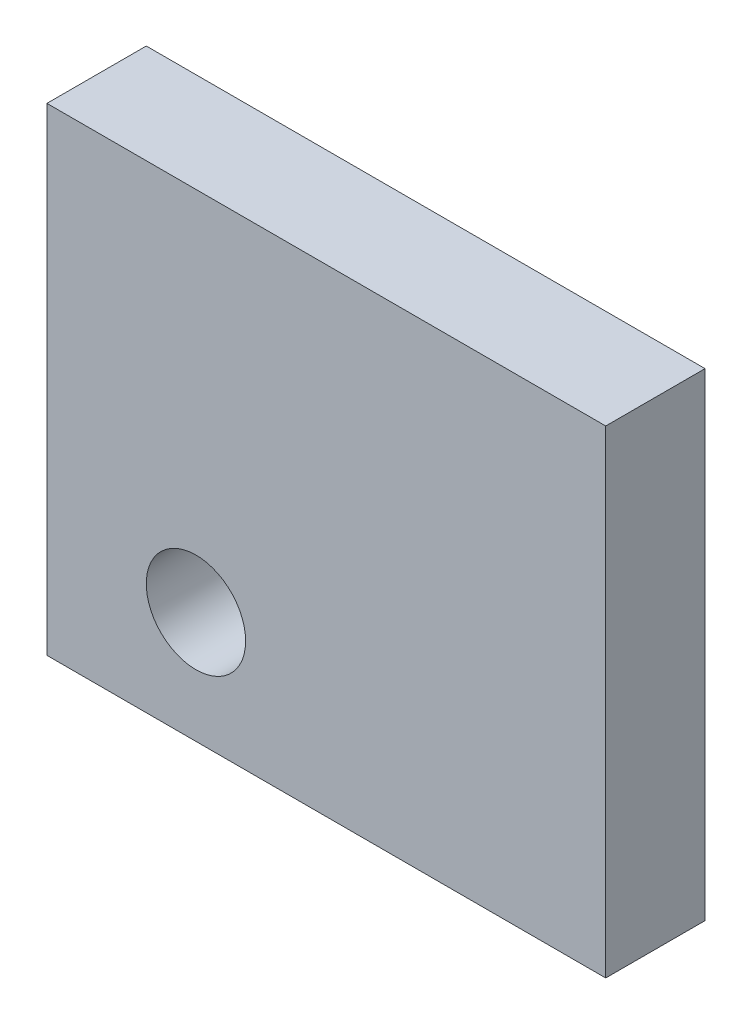
ISO-10303-21;
HEADER;
FILE_DESCRIPTION(('STEP AP214'),'2;1');
FILE_NAME('part.step','',(''),(''),'','','');
FILE_SCHEMA(('AUTOMOTIVE_DESIGN { 1 0 10303 214 1 1 1 1 }'));
ENDSEC;
DATA;
#1=APPLICATION_CONTEXT('core data for automotive mechanical design processes');
#2=APPLICATION_PROTOCOL_DEFINITION('international standard','automotive_design',2000,#1);
#3=PRODUCT_CONTEXT('',#1,'mechanical');
#4=PRODUCT('Part','Part','',(#3));
#5=PRODUCT_RELATED_PRODUCT_CATEGORY('part','',(#4));
#6=PRODUCT_DEFINITION_FORMATION('','',#4);
#7=PRODUCT_DEFINITION_CONTEXT('part definition',#1,'design');
#8=PRODUCT_DEFINITION('design','',#6,#7);
#9=PRODUCT_DEFINITION_SHAPE('','',#8);
#10=(LENGTH_UNIT() NAMED_UNIT(*) SI_UNIT(.MILLI.,.METRE.));
#11=(NAMED_UNIT(*) PLANE_ANGLE_UNIT() SI_UNIT($,.RADIAN.));
#12=(NAMED_UNIT(*) SI_UNIT($,.STERADIAN.) SOLID_ANGLE_UNIT());
#13=UNCERTAINTY_MEASURE_WITH_UNIT(LENGTH_MEASURE(1.E-05),#10,'distance_accuracy_value','');
#14=(GEOMETRIC_REPRESENTATION_CONTEXT(3) GLOBAL_UNCERTAINTY_ASSIGNED_CONTEXT((#13)) GLOBAL_UNIT_ASSIGNED_CONTEXT((#10,
#11,#12)) REPRESENTATION_CONTEXT('',''));
#15=CARTESIAN_POINT('',(0.,0.,0.));
#16=DIRECTION('',(0.,0.,1.));
#17=DIRECTION('',(1.,0.,0.));
#18=AXIS2_PLACEMENT_3D('',#15,#16,#17);
#19=CARTESIAN_POINT('',(22.5,-13.5,8.));
#20=DIRECTION('',(-1.,0.,0.));
#21=DIRECTION('',(0.,-1.,0.));
#22=AXIS2_PLACEMENT_3D('',#19,#20,#21);
#23=PLANE('',#22);
#24=DIRECTION('',(0.,1.,0.));
#25=VECTOR('',#24,1.);
#26=CARTESIAN_POINT('',(22.5,-13.5,0.));
#27=LINE('',#26,#25);
#28=CARTESIAN_POINT('',(22.5,-13.5,0.));
#29=VERTEX_POINT('',#28);
#30=CARTESIAN_POINT('',(22.5,25.,0.));
#31=VERTEX_POINT('',#30);
#32=EDGE_CURVE('E98',#29,#31,#27,.T.);
#33=ORIENTED_EDGE('',*,*,#32,.T.);
#34=DIRECTION('',(0.,0.,-1.));
#35=VECTOR('',#34,1.);
#36=CARTESIAN_POINT('',(22.5,25.,8.));
#37=LINE('',#36,#35);
#38=CARTESIAN_POINT('',(22.5,25.,8.));
#39=VERTEX_POINT('',#38);
#40=EDGE_CURVE('E11',#39,#31,#37,.T.);
#41=ORIENTED_EDGE('',*,*,#40,.F.);
#42=DIRECTION('',(0.,1.,0.));
#43=VECTOR('',#42,1.);
#44=CARTESIAN_POINT('',(22.5,-13.5,8.));
#45=LINE('',#44,#43);
#46=CARTESIAN_POINT('',(22.5,-13.5,8.));
#47=VERTEX_POINT('',#46);
#48=EDGE_CURVE('E86',#47,#39,#45,.T.);
#49=ORIENTED_EDGE('',*,*,#48,.F.);
#50=DIRECTION('',(0.,0.,-1.));
#51=VECTOR('',#50,1.);
#52=CARTESIAN_POINT('',(22.5,-13.5,8.));
#53=LINE('',#52,#51);
#54=EDGE_CURVE('E94',#47,#29,#53,.T.);
#55=ORIENTED_EDGE('',*,*,#54,.T.);
#56=EDGE_LOOP('',(#33,#41,#49,#55));
#57=FACE_BOUND('',#56,.T.);
#58=ADVANCED_FACE('F35',(#57),#23,.F.);
#59=CARTESIAN_POINT('',(-22.5,25.,8.));
#60=DIRECTION('',(0.,-1.,0.));
#61=DIRECTION('',(0.,0.,-1.));
#62=AXIS2_PLACEMENT_3D('',#59,#60,#61);
#63=PLANE('',#62);
#64=DIRECTION('',(-1.,0.,0.));
#65=VECTOR('',#64,1.);
#66=CARTESIAN_POINT('',(-22.5,25.,0.));
#67=LINE('',#66,#65);
#68=CARTESIAN_POINT('',(-22.5,25.,0.));
#69=VERTEX_POINT('',#68);
#70=EDGE_CURVE('E90',#31,#69,#67,.T.);
#71=ORIENTED_EDGE('',*,*,#70,.T.);
#72=DIRECTION('',(0.,0.,-1.));
#73=VECTOR('',#72,1.);
#74=CARTESIAN_POINT('',(-22.5,25.,8.));
#75=LINE('',#74,#73);
#76=CARTESIAN_POINT('',(-22.5,25.,8.));
#77=VERTEX_POINT('',#76);
#78=EDGE_CURVE('E43',#77,#69,#75,.T.);
#79=ORIENTED_EDGE('',*,*,#78,.F.);
#80=DIRECTION('',(-1.,0.,0.));
#81=VECTOR('',#80,1.);
#82=CARTESIAN_POINT('',(-22.5,25.,8.));
#83=LINE('',#82,#81);
#84=EDGE_CURVE('E81',#39,#77,#83,.T.);
#85=ORIENTED_EDGE('',*,*,#84,.F.);
#86=ORIENTED_EDGE('',*,*,#40,.T.);
#87=EDGE_LOOP('',(#71,#79,#85,#86));
#88=FACE_BOUND('',#87,.T.);
#89=ADVANCED_FACE('F89',(#88),#63,.F.);
#90=CARTESIAN_POINT('',(-22.5,-13.5,8.));
#91=DIRECTION('',(1.,0.,0.));
#92=DIRECTION('',(0.,0.,-1.));
#93=AXIS2_PLACEMENT_3D('',#90,#91,#92);
#94=PLANE('',#93);
#95=DIRECTION('',(0.,-1.,0.));
#96=VECTOR('',#95,1.);
#97=CARTESIAN_POINT('',(-22.5,-13.5,0.));
#98=LINE('',#97,#96);
#99=CARTESIAN_POINT('',(-22.5,-13.5,0.));
#100=VERTEX_POINT('',#99);
#101=EDGE_CURVE('E68',#69,#100,#98,.T.);
#102=ORIENTED_EDGE('',*,*,#101,.T.);
#103=DIRECTION('',(0.,0.,-1.));
#104=VECTOR('',#103,1.);
#105=CARTESIAN_POINT('',(-22.5,-13.5,8.));
#106=LINE('',#105,#104);
#107=CARTESIAN_POINT('',(-22.5,-13.5,8.));
#108=VERTEX_POINT('',#107);
#109=EDGE_CURVE('E91',#108,#100,#106,.T.);
#110=ORIENTED_EDGE('',*,*,#109,.F.);
#111=DIRECTION('',(0.,-1.,0.));
#112=VECTOR('',#111,1.);
#113=CARTESIAN_POINT('',(-22.5,-13.5,8.));
#114=LINE('',#113,#112);
#115=EDGE_CURVE('E84',#77,#108,#114,.T.);
#116=ORIENTED_EDGE('',*,*,#115,.F.);
#117=ORIENTED_EDGE('',*,*,#78,.T.);
#118=EDGE_LOOP('',(#102,#110,#116,#117));
#119=FACE_BOUND('',#118,.T.);
#120=ADVANCED_FACE('F92',(#119),#94,.F.);
#121=CARTESIAN_POINT('',(-22.5,-13.5,8.));
#122=DIRECTION('',(0.,1.,0.));
#123=DIRECTION('',(-1.,0.,0.));
#124=AXIS2_PLACEMENT_3D('',#121,#122,#123);
#125=PLANE('',#124);
#126=DIRECTION('',(1.,0.,0.));
#127=VECTOR('',#126,1.);
#128=CARTESIAN_POINT('',(-22.5,-13.5,0.));
#129=LINE('',#128,#127);
#130=EDGE_CURVE('E74',#100,#29,#129,.T.);
#131=ORIENTED_EDGE('',*,*,#130,.T.);
#132=ORIENTED_EDGE('',*,*,#54,.F.);
#133=DIRECTION('',(1.,0.,0.));
#134=VECTOR('',#133,1.);
#135=CARTESIAN_POINT('',(-22.5,-13.5,8.));
#136=LINE('',#135,#134);
#137=EDGE_CURVE('E51',#108,#47,#136,.T.);
#138=ORIENTED_EDGE('',*,*,#137,.F.);
#139=ORIENTED_EDGE('',*,*,#109,.T.);
#140=EDGE_LOOP('',(#131,#132,#138,#139));
#141=FACE_BOUND('',#140,.T.);
#142=ADVANCED_FACE('F106',(#141),#125,.F.);
#143=CARTESIAN_POINT('',(0.,0.,8.));
#144=DIRECTION('',(0.,0.,-1.));
#145=DIRECTION('',(-1.,0.,0.));
#146=AXIS2_PLACEMENT_3D('',#143,#144,#145);
#147=PLANE('',#146);
#148=CARTESIAN_POINT('',(-10.5,-4.5,8.));
#149=DIRECTION('',(0.,0.,1.));
#150=DIRECTION('',(1.,0.,0.));
#151=AXIS2_PLACEMENT_3D('',#148,#149,#150);
#152=CIRCLE('',#151,4.);
#153=CARTESIAN_POINT('',(-6.5,-4.5,8.));
#154=VERTEX_POINT('',#153);
#155=EDGE_CURVE('E114',#154,#154,#152,.T.);
#156=ORIENTED_EDGE('',*,*,#155,.F.);
#157=EDGE_LOOP('',(#156));
#158=FACE_BOUND('',#157,.T.);
#159=ORIENTED_EDGE('',*,*,#48,.T.);
#160=ORIENTED_EDGE('',*,*,#84,.T.);
#161=ORIENTED_EDGE('',*,*,#115,.T.);
#162=ORIENTED_EDGE('',*,*,#137,.T.);
#163=EDGE_LOOP('',(#159,#160,#161,#162));
#164=FACE_BOUND('',#163,.T.);
#165=ADVANCED_FACE('F82',(#158,#164),#147,.F.);
#166=CARTESIAN_POINT('',(0.,0.,0.));
#167=DIRECTION('',(0.,0.,-1.));
#168=DIRECTION('',(-1.,0.,0.));
#169=AXIS2_PLACEMENT_3D('',#166,#167,#168);
#170=PLANE('',#169);
#171=CARTESIAN_POINT('',(-10.5,-4.5,0.));
#172=DIRECTION('',(0.,0.,-1.));
#173=DIRECTION('',(-1.,0.,0.));
#174=AXIS2_PLACEMENT_3D('',#171,#172,#173);
#175=CIRCLE('',#174,4.);
#176=CARTESIAN_POINT('',(-14.5,-4.5,0.));
#177=VERTEX_POINT('',#176);
#178=EDGE_CURVE('E101',#177,#177,#175,.F.);
#179=ORIENTED_EDGE('',*,*,#178,.T.);
#180=EDGE_LOOP('',(#179));
#181=FACE_BOUND('',#180,.T.);
#182=ORIENTED_EDGE('',*,*,#32,.F.);
#183=ORIENTED_EDGE('',*,*,#130,.F.);
#184=ORIENTED_EDGE('',*,*,#101,.F.);
#185=ORIENTED_EDGE('',*,*,#70,.F.);
#186=EDGE_LOOP('',(#182,#183,#184,#185));
#187=FACE_BOUND('',#186,.T.);
#188=ADVANCED_FACE('F109',(#181,#187),#170,.T.);
#189=CARTESIAN_POINT('',(-10.5,-4.5,-11.3137084989848));
#190=DIRECTION('',(0.,0.,1.));
#191=DIRECTION('',(1.,0.,0.));
#192=AXIS2_PLACEMENT_3D('',#189,#190,#191);
#193=CYLINDRICAL_SURFACE('',#192,4.);
#194=ORIENTED_EDGE('',*,*,#155,.T.);
#195=EDGE_LOOP('',(#194));
#196=FACE_BOUND('',#195,.T.);
#197=ORIENTED_EDGE('',*,*,#178,.F.);
#198=EDGE_LOOP('',(#197));
#199=FACE_BOUND('',#198,.T.);
#200=ADVANCED_FACE('F118',(#196,#199),#193,.F.);
#201=CLOSED_SHELL('',(#58,#89,#120,#142,#165,#188,#200));
#202=MANIFOLD_SOLID_BREP('B2',#201);
#203=ADVANCED_BREP_SHAPE_REPRESENTATION('',(#18,#202),#14);
#204=SHAPE_DEFINITION_REPRESENTATION(#9,#203);
ENDSEC;
END-ISO-10303-21;
